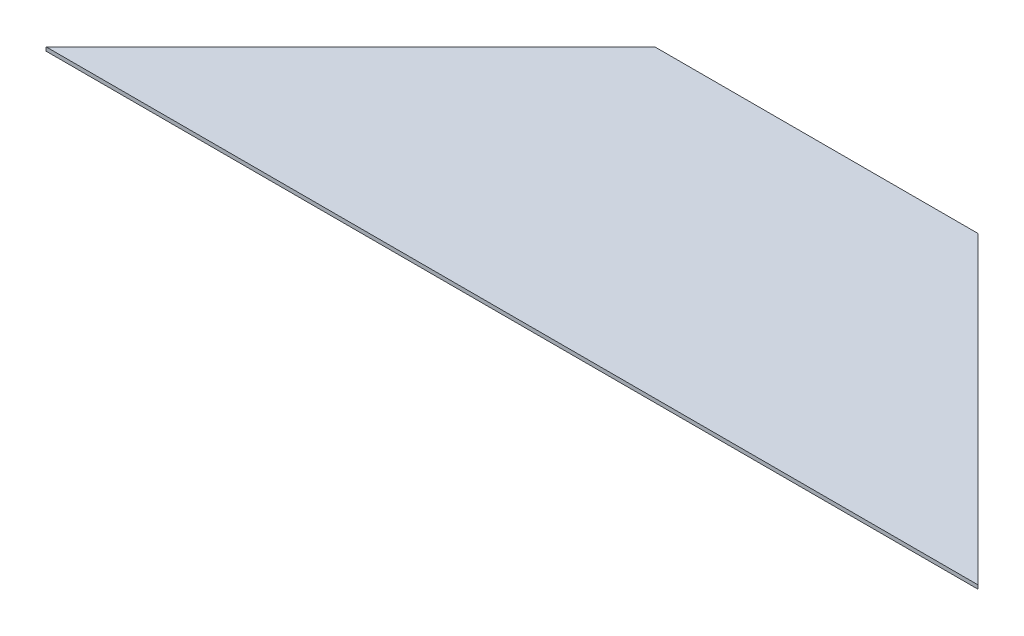
ISO-10303-21;
HEADER;
FILE_DESCRIPTION(('STEP AP214'),'2;1');
FILE_NAME('part.step','',(''),(''),'','','');
FILE_SCHEMA(('AUTOMOTIVE_DESIGN { 1 0 10303 214 1 1 1 1 }'));
ENDSEC;
DATA;
#1=APPLICATION_CONTEXT('core data for automotive mechanical design processes');
#2=APPLICATION_PROTOCOL_DEFINITION('international standard','automotive_design',2000,#1);
#3=PRODUCT_CONTEXT('',#1,'mechanical');
#4=PRODUCT('Part','Part','',(#3));
#5=PRODUCT_RELATED_PRODUCT_CATEGORY('part','',(#4));
#6=PRODUCT_DEFINITION_FORMATION('','',#4);
#7=PRODUCT_DEFINITION_CONTEXT('part definition',#1,'design');
#8=PRODUCT_DEFINITION('design','',#6,#7);
#9=PRODUCT_DEFINITION_SHAPE('','',#8);
#10=(LENGTH_UNIT() NAMED_UNIT(*) SI_UNIT(.MILLI.,.METRE.));
#11=(NAMED_UNIT(*) PLANE_ANGLE_UNIT() SI_UNIT($,.RADIAN.));
#12=(NAMED_UNIT(*) SI_UNIT($,.STERADIAN.) SOLID_ANGLE_UNIT());
#13=UNCERTAINTY_MEASURE_WITH_UNIT(LENGTH_MEASURE(1.E-05),#10,'distance_accuracy_value','');
#14=(GEOMETRIC_REPRESENTATION_CONTEXT(3) GLOBAL_UNCERTAINTY_ASSIGNED_CONTEXT((#13)) GLOBAL_UNIT_ASSIGNED_CONTEXT((#10,
#11,#12)) REPRESENTATION_CONTEXT('',''));
#15=CARTESIAN_POINT('',(0.,0.,0.));
#16=DIRECTION('',(0.,0.,1.));
#17=DIRECTION('',(1.,0.,0.));
#18=AXIS2_PLACEMENT_3D('',#15,#16,#17);
#19=CARTESIAN_POINT('',(160.000000000002,2.,-160.));
#20=DIRECTION('',(0.707106781186544,0.,0.707106781186551));
#21=DIRECTION('',(0.707106781186551,0.,-0.707106781186544));
#22=AXIS2_PLACEMENT_3D('',#19,#20,#21);
#23=PLANE('',#22);
#24=DIRECTION('',(-0.707106781186551,0.,0.707106781186544));
#25=VECTOR('',#24,1.);
#26=CARTESIAN_POINT('',(160.000000000002,0.,-160.));
#27=LINE('',#26,#25);
#28=CARTESIAN_POINT('',(160.000000000002,0.,-160.));
#29=VERTEX_POINT('',#28);
#30=CARTESIAN_POINT('',(0.,0.,0.));
#31=VERTEX_POINT('',#30);
#32=EDGE_CURVE('E98',#29,#31,#27,.T.);
#33=ORIENTED_EDGE('',*,*,#32,.T.);
#34=DIRECTION('',(0.,-1.,0.));
#35=VECTOR('',#34,1.);
#36=CARTESIAN_POINT('',(0.,2.,0.));
#37=LINE('',#36,#35);
#38=CARTESIAN_POINT('',(0.,2.,0.));
#39=VERTEX_POINT('',#38);
#40=EDGE_CURVE('E11',#39,#31,#37,.T.);
#41=ORIENTED_EDGE('',*,*,#40,.F.);
#42=DIRECTION('',(-0.707106781186551,0.,0.707106781186544));
#43=VECTOR('',#42,1.);
#44=CARTESIAN_POINT('',(160.000000000002,2.,-160.));
#45=LINE('',#44,#43);
#46=CARTESIAN_POINT('',(160.000000000002,2.,-160.));
#47=VERTEX_POINT('',#46);
#48=EDGE_CURVE('E86',#47,#39,#45,.T.);
#49=ORIENTED_EDGE('',*,*,#48,.F.);
#50=DIRECTION('',(0.,-1.,0.));
#51=VECTOR('',#50,1.);
#52=CARTESIAN_POINT('',(160.000000000002,2.,-160.));
#53=LINE('',#52,#51);
#54=EDGE_CURVE('E94',#47,#29,#53,.T.);
#55=ORIENTED_EDGE('',*,*,#54,.T.);
#56=EDGE_LOOP('',(#33,#41,#49,#55));
#57=FACE_BOUND('',#56,.T.);
#58=ADVANCED_FACE('F35',(#57),#23,.F.);
#59=CARTESIAN_POINT('',(0.,2.,0.));
#60=DIRECTION('',(0.,0.,-1.));
#61=DIRECTION('',(-1.,0.,0.));
#62=AXIS2_PLACEMENT_3D('',#59,#60,#61);
#63=PLANE('',#62);
#64=DIRECTION('',(1.,0.,0.));
#65=VECTOR('',#64,1.);
#66=CARTESIAN_POINT('',(0.,0.,0.));
#67=LINE('',#66,#65);
#68=CARTESIAN_POINT('',(490.,0.,0.));
#69=VERTEX_POINT('',#68);
#70=EDGE_CURVE('E90',#31,#69,#67,.T.);
#71=ORIENTED_EDGE('',*,*,#70,.T.);
#72=DIRECTION('',(0.,-1.,0.));
#73=VECTOR('',#72,1.);
#74=CARTESIAN_POINT('',(490.,2.,0.));
#75=LINE('',#74,#73);
#76=CARTESIAN_POINT('',(490.,2.,0.));
#77=VERTEX_POINT('',#76);
#78=EDGE_CURVE('E43',#77,#69,#75,.T.);
#79=ORIENTED_EDGE('',*,*,#78,.F.);
#80=DIRECTION('',(1.,0.,0.));
#81=VECTOR('',#80,1.);
#82=CARTESIAN_POINT('',(0.,2.,0.));
#83=LINE('',#82,#81);
#84=EDGE_CURVE('E81',#39,#77,#83,.T.);
#85=ORIENTED_EDGE('',*,*,#84,.F.);
#86=ORIENTED_EDGE('',*,*,#40,.T.);
#87=EDGE_LOOP('',(#71,#79,#85,#86));
#88=FACE_BOUND('',#87,.T.);
#89=ADVANCED_FACE('F89',(#88),#63,.F.);
#90=CARTESIAN_POINT('',(490.,2.,0.));
#91=DIRECTION('',(-0.707106781186544,0.,0.707106781186552));
#92=DIRECTION('',(0.707106781186552,0.,0.707106781186544));
#93=AXIS2_PLACEMENT_3D('',#90,#91,#92);
#94=PLANE('',#93);
#95=DIRECTION('',(-0.707106781186552,0.,-0.707106781186544));
#96=VECTOR('',#95,1.);
#97=CARTESIAN_POINT('',(490.,0.,0.));
#98=LINE('',#97,#96);
#99=CARTESIAN_POINT('',(329.999999999998,0.,-160.));
#100=VERTEX_POINT('',#99);
#101=EDGE_CURVE('E68',#69,#100,#98,.T.);
#102=ORIENTED_EDGE('',*,*,#101,.T.);
#103=DIRECTION('',(0.,-1.,0.));
#104=VECTOR('',#103,1.);
#105=CARTESIAN_POINT('',(329.999999999998,2.,-160.));
#106=LINE('',#105,#104);
#107=CARTESIAN_POINT('',(329.999999999998,2.,-160.));
#108=VERTEX_POINT('',#107);
#109=EDGE_CURVE('E91',#108,#100,#106,.T.);
#110=ORIENTED_EDGE('',*,*,#109,.F.);
#111=DIRECTION('',(-0.707106781186552,0.,-0.707106781186544));
#112=VECTOR('',#111,1.);
#113=CARTESIAN_POINT('',(490.,2.,0.));
#114=LINE('',#113,#112);
#115=EDGE_CURVE('E84',#77,#108,#114,.T.);
#116=ORIENTED_EDGE('',*,*,#115,.F.);
#117=ORIENTED_EDGE('',*,*,#78,.T.);
#118=EDGE_LOOP('',(#102,#110,#116,#117));
#119=FACE_BOUND('',#118,.T.);
#120=ADVANCED_FACE('F92',(#119),#94,.F.);
#121=CARTESIAN_POINT('',(329.999999999998,2.,-160.));
#122=DIRECTION('',(0.,0.,1.));
#123=DIRECTION('',(1.,0.,0.));
#124=AXIS2_PLACEMENT_3D('',#121,#122,#123);
#125=PLANE('',#124);
#126=DIRECTION('',(-1.,0.,0.));
#127=VECTOR('',#126,1.);
#128=CARTESIAN_POINT('',(329.999999999998,0.,-160.));
#129=LINE('',#128,#127);
#130=EDGE_CURVE('E74',#100,#29,#129,.T.);
#131=ORIENTED_EDGE('',*,*,#130,.T.);
#132=ORIENTED_EDGE('',*,*,#54,.F.);
#133=DIRECTION('',(-1.,0.,0.));
#134=VECTOR('',#133,1.);
#135=CARTESIAN_POINT('',(329.999999999998,2.,-160.));
#136=LINE('',#135,#134);
#137=EDGE_CURVE('E51',#108,#47,#136,.T.);
#138=ORIENTED_EDGE('',*,*,#137,.F.);
#139=ORIENTED_EDGE('',*,*,#109,.T.);
#140=EDGE_LOOP('',(#131,#132,#138,#139));
#141=FACE_BOUND('',#140,.T.);
#142=ADVANCED_FACE('F105',(#141),#125,.F.);
#143=CARTESIAN_POINT('',(0.,2.,0.));
#144=DIRECTION('',(0.,-1.,0.));
#145=DIRECTION('',(0.,0.,-1.));
#146=AXIS2_PLACEMENT_3D('',#143,#144,#145);
#147=PLANE('',#146);
#148=ORIENTED_EDGE('',*,*,#48,.T.);
#149=ORIENTED_EDGE('',*,*,#84,.T.);
#150=ORIENTED_EDGE('',*,*,#115,.T.);
#151=ORIENTED_EDGE('',*,*,#137,.T.);
#152=EDGE_LOOP('',(#148,#149,#150,#151));
#153=FACE_BOUND('',#152,.T.);
#154=ADVANCED_FACE('F82',(#153),#147,.F.);
#155=CARTESIAN_POINT('',(0.,0.,0.));
#156=DIRECTION('',(0.,-1.,0.));
#157=DIRECTION('',(0.,0.,-1.));
#158=AXIS2_PLACEMENT_3D('',#155,#156,#157);
#159=PLANE('',#158);
#160=ORIENTED_EDGE('',*,*,#32,.F.);
#161=ORIENTED_EDGE('',*,*,#130,.F.);
#162=ORIENTED_EDGE('',*,*,#101,.F.);
#163=ORIENTED_EDGE('',*,*,#70,.F.);
#164=EDGE_LOOP('',(#160,#161,#162,#163));
#165=FACE_BOUND('',#164,.T.);
#166=ADVANCED_FACE('F108',(#165),#159,.T.);
#167=CLOSED_SHELL('',(#58,#89,#120,#142,#154,#166));
#168=MANIFOLD_SOLID_BREP('B2',#167);
#169=ADVANCED_BREP_SHAPE_REPRESENTATION('',(#18,#168),#14);
#170=SHAPE_DEFINITION_REPRESENTATION(#9,#169);
ENDSEC;
END-ISO-10303-21;
